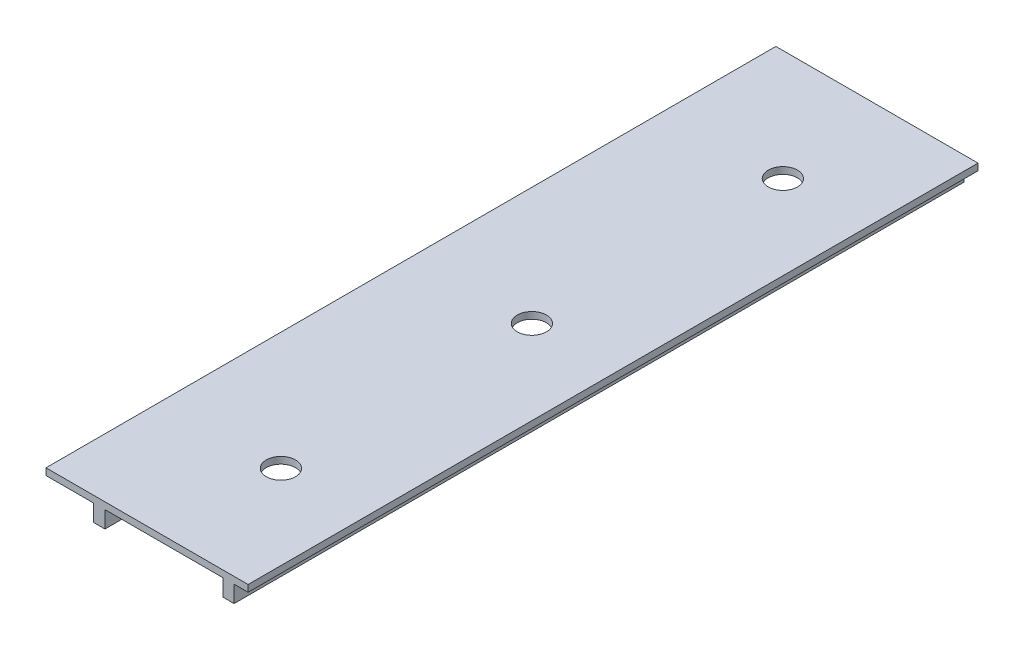
ISO-10303-21;
HEADER;
FILE_DESCRIPTION(('STEP AP214'),'2;1');
FILE_NAME('part.step','',(''),(''),'','','');
FILE_SCHEMA(('AUTOMOTIVE_DESIGN { 1 0 10303 214 1 1 1 1 }'));
ENDSEC;
DATA;
#1=APPLICATION_CONTEXT('core data for automotive mechanical design processes');
#2=APPLICATION_PROTOCOL_DEFINITION('international standard','automotive_design',2000,#1);
#3=PRODUCT_CONTEXT('',#1,'mechanical');
#4=PRODUCT('Part','Part','',(#3));
#5=PRODUCT_RELATED_PRODUCT_CATEGORY('part','',(#4));
#6=PRODUCT_DEFINITION_FORMATION('','',#4);
#7=PRODUCT_DEFINITION_CONTEXT('part definition',#1,'design');
#8=PRODUCT_DEFINITION('design','',#6,#7);
#9=PRODUCT_DEFINITION_SHAPE('','',#8);
#10=(LENGTH_UNIT() NAMED_UNIT(*) SI_UNIT(.MILLI.,.METRE.));
#11=(NAMED_UNIT(*) PLANE_ANGLE_UNIT() SI_UNIT($,.RADIAN.));
#12=(NAMED_UNIT(*) SI_UNIT($,.STERADIAN.) SOLID_ANGLE_UNIT());
#13=UNCERTAINTY_MEASURE_WITH_UNIT(LENGTH_MEASURE(1.E-05),#10,'distance_accuracy_value','');
#14=(GEOMETRIC_REPRESENTATION_CONTEXT(3) GLOBAL_UNCERTAINTY_ASSIGNED_CONTEXT((#13)) GLOBAL_UNIT_ASSIGNED_CONTEXT((#10,
#11,#12)) REPRESENTATION_CONTEXT('',''));
#15=CARTESIAN_POINT('',(0.,0.,0.));
#16=DIRECTION('',(0.,0.,1.));
#17=DIRECTION('',(1.,0.,0.));
#18=AXIS2_PLACEMENT_3D('',#15,#16,#17);
#19=CARTESIAN_POINT('',(0.,0.,0.));
#20=DIRECTION('',(0.,-1.,0.));
#21=DIRECTION('',(0.,0.,-1.));
#22=AXIS2_PLACEMENT_3D('',#19,#20,#21);
#23=PLANE('',#22);
#24=CARTESIAN_POINT('',(10.5,0.,-10.4182940778282));
#25=DIRECTION('',(0.,-1.,0.));
#26=DIRECTION('',(0.,0.,-1.));
#27=AXIS2_PLACEMENT_3D('',#24,#25,#26);
#28=CIRCLE('',#27,1.325);
#29=CARTESIAN_POINT('',(9.69281942065692,0.,-11.469048336602));
#30=VERTEX_POINT('',#29);
#31=CARTESIAN_POINT('',(11.3071805793415,0.,-11.4690483366033));
#32=VERTEX_POINT('',#31);
#33=EDGE_CURVE('E43',#30,#32,#28,.T.);
#34=ORIENTED_EDGE('',*,*,#33,.T.);
#35=CARTESIAN_POINT('',(10.5,0.,-10.45));
#36=DIRECTION('',(0.,-1.,0.));
#37=DIRECTION('',(0.,0.,-1.));
#38=AXIS2_PLACEMENT_3D('',#35,#36,#37);
#39=CIRCLE('',#38,1.3);
#40=EDGE_CURVE('E169',#30,#32,#39,.T.);
#41=ORIENTED_EDGE('',*,*,#40,.F.);
#42=EDGE_LOOP('',(#34,#41));
#43=FACE_BOUND('',#42,.T.);
#44=CARTESIAN_POINT('',(10.5,0.,-10.42));
#45=DIRECTION('',(0.,-1.,0.));
#46=DIRECTION('',(0.,0.,-1.));
#47=AXIS2_PLACEMENT_3D('',#44,#45,#46);
#48=CIRCLE('',#47,1.3);
#49=CARTESIAN_POINT('',(10.5,0.,-11.72));
#50=VERTEX_POINT('',#49);
#51=EDGE_CURVE('E249',#50,#50,#48,.T.);
#52=ORIENTED_EDGE('',*,*,#51,.F.);
#53=EDGE_LOOP('',(#52));
#54=FACE_BOUND('',#53,.T.);
#55=CARTESIAN_POINT('',(10.5,0.,-32.77));
#56=DIRECTION('',(0.,-1.,0.));
#57=DIRECTION('',(0.,0.,-1.));
#58=AXIS2_PLACEMENT_3D('',#55,#56,#57);
#59=CIRCLE('',#58,1.3);
#60=CARTESIAN_POINT('',(10.5,0.,-34.07));
#61=VERTEX_POINT('',#60);
#62=EDGE_CURVE('E271',#61,#61,#59,.T.);
#63=ORIENTED_EDGE('',*,*,#62,.F.);
#64=EDGE_LOOP('',(#63));
#65=FACE_BOUND('',#64,.T.);
#66=DIRECTION('',(0.,0.,-1.));
#67=VECTOR('',#66,1.);
#68=CARTESIAN_POINT('',(15.75,0.,0.));
#69=LINE('',#68,#67);
#70=CARTESIAN_POINT('',(15.75,0.,0.));
#71=VERTEX_POINT('',#70);
#72=CARTESIAN_POINT('',(15.75,0.,-65.));
#73=VERTEX_POINT('',#72);
#74=EDGE_CURVE('E179',#71,#73,#69,.T.);
#75=ORIENTED_EDGE('',*,*,#74,.F.);
#76=DIRECTION('',(1.,0.,0.));
#77=VECTOR('',#76,1.);
#78=CARTESIAN_POINT('',(0.,0.,0.));
#79=LINE('',#78,#77);
#80=CARTESIAN_POINT('',(5.25,0.,0.));
#81=VERTEX_POINT('',#80);
#82=EDGE_CURVE('E253',#81,#71,#79,.T.);
#83=ORIENTED_EDGE('',*,*,#82,.F.);
#84=DIRECTION('',(0.,0.,-1.));
#85=VECTOR('',#84,1.);
#86=CARTESIAN_POINT('',(5.25,0.,0.));
#87=LINE('',#86,#85);
#88=CARTESIAN_POINT('',(5.25,0.,-65.));
#89=VERTEX_POINT('',#88);
#90=EDGE_CURVE('E199',#81,#89,#87,.T.);
#91=ORIENTED_EDGE('',*,*,#90,.T.);
#92=DIRECTION('',(-1.,0.,0.));
#93=VECTOR('',#92,1.);
#94=CARTESIAN_POINT('',(0.,0.,-65.));
#95=LINE('',#94,#93);
#96=EDGE_CURVE('E257',#73,#89,#95,.T.);
#97=ORIENTED_EDGE('',*,*,#96,.F.);
#98=EDGE_LOOP('',(#75,#83,#91,#97));
#99=FACE_BOUND('',#98,.T.);
#100=CARTESIAN_POINT('',(10.5,0.,-55.15));
#101=DIRECTION('',(0.,-1.,0.));
#102=DIRECTION('',(0.,0.,-1.));
#103=AXIS2_PLACEMENT_3D('',#100,#101,#102);
#104=CIRCLE('',#103,1.3);
#105=CARTESIAN_POINT('',(9.77453570900865,0.,-56.2287499999984));
#106=VERTEX_POINT('',#105);
#107=CARTESIAN_POINT('',(11.2254642909895,0.,-56.2287499999996));
#108=VERTEX_POINT('',#107);
#109=EDGE_CURVE('E165',#106,#108,#104,.T.);
#110=ORIENTED_EDGE('',*,*,#109,.F.);
#111=CARTESIAN_POINT('',(10.5,0.,-55.12));
#112=DIRECTION('',(0.,-1.,0.));
#113=DIRECTION('',(0.,0.,-1.));
#114=AXIS2_PLACEMENT_3D('',#111,#112,#113);
#115=CIRCLE('',#114,1.325);
#116=EDGE_CURVE('E11',#106,#108,#115,.T.);
#117=ORIENTED_EDGE('',*,*,#116,.T.);
#118=EDGE_LOOP('',(#110,#117));
#119=FACE_BOUND('',#118,.T.);
#120=CARTESIAN_POINT('',(10.5,0.,-55.12));
#121=DIRECTION('',(0.,-1.,0.));
#122=DIRECTION('',(0.,0.,-1.));
#123=AXIS2_PLACEMENT_3D('',#120,#121,#122);
#124=CIRCLE('',#123,1.3);
#125=CARTESIAN_POINT('',(10.5,0.,-56.42));
#126=VERTEX_POINT('',#125);
#127=EDGE_CURVE('E228',#126,#126,#124,.T.);
#128=ORIENTED_EDGE('',*,*,#127,.F.);
#129=EDGE_LOOP('',(#128));
#130=FACE_BOUND('',#129,.T.);
#131=ADVANCED_FACE('F35',(#43,#54,#65,#99,#119,#130),#23,.T.);
#132=DIRECTION('',(0.,0.,-1.));
#133=VECTOR('',#132,1.);
#134=CARTESIAN_POINT('',(16.75,0.,0.));
#135=LINE('',#134,#133);
#136=CARTESIAN_POINT('',(16.75,0.,0.));
#137=VERTEX_POINT('',#136);
#138=CARTESIAN_POINT('',(16.75,0.,-65.));
#139=VERTEX_POINT('',#138);
#140=EDGE_CURVE('E174',#137,#139,#135,.T.);
#141=ORIENTED_EDGE('',*,*,#140,.T.);
#142=CARTESIAN_POINT('',(18.,0.,-65.));
#143=VERTEX_POINT('',#142);
#144=EDGE_CURVE('E238',#143,#139,#95,.T.);
#145=ORIENTED_EDGE('',*,*,#144,.F.);
#146=DIRECTION('',(0.,0.,-1.));
#147=VECTOR('',#146,1.);
#148=CARTESIAN_POINT('',(18.,0.,0.));
#149=LINE('',#148,#147);
#150=CARTESIAN_POINT('',(18.,0.,0.));
#151=VERTEX_POINT('',#150);
#152=EDGE_CURVE('E252',#151,#143,#149,.T.);
#153=ORIENTED_EDGE('',*,*,#152,.F.);
#154=EDGE_CURVE('E248',#137,#151,#79,.T.);
#155=ORIENTED_EDGE('',*,*,#154,.F.);
#156=EDGE_LOOP('',(#141,#145,#153,#155));
#157=FACE_BOUND('',#156,.T.);
#158=ADVANCED_FACE('F278',(#157),#23,.T.);
#159=CARTESIAN_POINT('',(0.,0.6,0.));
#160=DIRECTION('',(1.,0.,0.));
#161=DIRECTION('',(0.,0.,-1.));
#162=AXIS2_PLACEMENT_3D('',#159,#160,#161);
#163=PLANE('',#162);
#164=DIRECTION('',(0.,0.,1.));
#165=VECTOR('',#164,1.);
#166=CARTESIAN_POINT('',(0.,0.,0.));
#167=LINE('',#166,#165);
#168=CARTESIAN_POINT('',(0.,0.,-65.));
#169=VERTEX_POINT('',#168);
#170=CARTESIAN_POINT('',(0.,0.,0.));
#171=VERTEX_POINT('',#170);
#172=EDGE_CURVE('E245',#169,#171,#167,.T.);
#173=ORIENTED_EDGE('',*,*,#172,.T.);
#174=DIRECTION('',(0.,-1.,0.));
#175=VECTOR('',#174,1.);
#176=CARTESIAN_POINT('',(0.,0.6,0.));
#177=LINE('',#176,#175);
#178=CARTESIAN_POINT('',(0.,0.6,0.));
#179=VERTEX_POINT('',#178);
#180=EDGE_CURVE('E266',#179,#171,#177,.T.);
#181=ORIENTED_EDGE('',*,*,#180,.F.);
#182=DIRECTION('',(0.,0.,1.));
#183=VECTOR('',#182,1.);
#184=CARTESIAN_POINT('',(0.,0.6,0.));
#185=LINE('',#184,#183);
#186=CARTESIAN_POINT('',(0.,0.6,-65.));
#187=VERTEX_POINT('',#186);
#188=EDGE_CURVE('E234',#187,#179,#185,.T.);
#189=ORIENTED_EDGE('',*,*,#188,.F.);
#190=DIRECTION('',(0.,-1.,0.));
#191=VECTOR('',#190,1.);
#192=CARTESIAN_POINT('',(0.,0.6,-65.));
#193=LINE('',#192,#191);
#194=EDGE_CURVE('E244',#187,#169,#193,.T.);
#195=ORIENTED_EDGE('',*,*,#194,.T.);
#196=EDGE_LOOP('',(#173,#181,#189,#195));
#197=FACE_BOUND('',#196,.T.);
#198=ADVANCED_FACE('F37',(#197),#163,.F.);
#199=CARTESIAN_POINT('',(0.,0.6,0.));
#200=DIRECTION('',(0.,0.,-1.));
#201=DIRECTION('',(-1.,0.,0.));
#202=AXIS2_PLACEMENT_3D('',#199,#200,#201);
#203=PLANE('',#202);
#204=CARTESIAN_POINT('',(4.24999999999999,0.,0.));
#205=VERTEX_POINT('',#204);
#206=EDGE_CURVE('E250',#171,#205,#79,.T.);
#207=ORIENTED_EDGE('',*,*,#206,.T.);
#208=DIRECTION('',(0.,1.,0.));
#209=VECTOR('',#208,1.);
#210=CARTESIAN_POINT('',(4.24999999999999,-1.5,0.));
#211=LINE('',#210,#209);
#212=CARTESIAN_POINT('',(4.24999999999999,-1.5,0.));
#213=VERTEX_POINT('',#212);
#214=EDGE_CURVE('E216',#213,#205,#211,.T.);
#215=ORIENTED_EDGE('',*,*,#214,.F.);
#216=DIRECTION('',(-1.,0.,0.));
#217=VECTOR('',#216,1.);
#218=CARTESIAN_POINT('',(0.,-1.5,0.));
#219=LINE('',#218,#217);
#220=CARTESIAN_POINT('',(5.25,-1.5,0.));
#221=VERTEX_POINT('',#220);
#222=EDGE_CURVE('E206',#221,#213,#219,.T.);
#223=ORIENTED_EDGE('',*,*,#222,.F.);
#224=DIRECTION('',(0.,1.,0.));
#225=VECTOR('',#224,1.);
#226=CARTESIAN_POINT('',(5.25,-1.5,0.));
#227=LINE('',#226,#225);
#228=EDGE_CURVE('E219',#221,#81,#227,.T.);
#229=ORIENTED_EDGE('',*,*,#228,.T.);
#230=ORIENTED_EDGE('',*,*,#82,.T.);
#231=DIRECTION('',(0.,1.,0.));
#232=VECTOR('',#231,1.);
#233=CARTESIAN_POINT('',(15.75,-1.5,0.));
#234=LINE('',#233,#232);
#235=CARTESIAN_POINT('',(15.75,-1.5,0.));
#236=VERTEX_POINT('',#235);
#237=EDGE_CURVE('E194',#236,#71,#234,.T.);
#238=ORIENTED_EDGE('',*,*,#237,.F.);
#239=DIRECTION('',(-1.,0.,0.));
#240=VECTOR('',#239,1.);
#241=CARTESIAN_POINT('',(0.,-1.5,0.));
#242=LINE('',#241,#240);
#243=CARTESIAN_POINT('',(16.75,-1.5,0.));
#244=VERTEX_POINT('',#243);
#245=EDGE_CURVE('E178',#244,#236,#242,.T.);
#246=ORIENTED_EDGE('',*,*,#245,.F.);
#247=DIRECTION('',(0.,1.,0.));
#248=VECTOR('',#247,1.);
#249=CARTESIAN_POINT('',(16.75,-1.5,0.));
#250=LINE('',#249,#248);
#251=EDGE_CURVE('E197',#244,#137,#250,.T.);
#252=ORIENTED_EDGE('',*,*,#251,.T.);
#253=ORIENTED_EDGE('',*,*,#154,.T.);
#254=DIRECTION('',(0.,-1.,0.));
#255=VECTOR('',#254,1.);
#256=CARTESIAN_POINT('',(18.,0.6,0.));
#257=LINE('',#256,#255);
#258=CARTESIAN_POINT('',(18.,0.6,0.));
#259=VERTEX_POINT('',#258);
#260=EDGE_CURVE('E263',#259,#151,#257,.T.);
#261=ORIENTED_EDGE('',*,*,#260,.F.);
#262=DIRECTION('',(1.,0.,0.));
#263=VECTOR('',#262,1.);
#264=CARTESIAN_POINT('',(0.,0.6,0.));
#265=LINE('',#264,#263);
#266=EDGE_CURVE('E237',#179,#259,#265,.T.);
#267=ORIENTED_EDGE('',*,*,#266,.F.);
#268=ORIENTED_EDGE('',*,*,#180,.T.);
#269=EDGE_LOOP('',(#207,#215,#223,#229,#230,#238,#246,#252,#253,#261,#267,#268));
#270=FACE_BOUND('',#269,.T.);
#271=ADVANCED_FACE('F333',(#270),#203,.F.);
#272=CARTESIAN_POINT('',(18.,0.6,0.));
#273=DIRECTION('',(-1.,0.,0.));
#274=DIRECTION('',(0.,0.,1.));
#275=AXIS2_PLACEMENT_3D('',#272,#273,#274);
#276=PLANE('',#275);
#277=ORIENTED_EDGE('',*,*,#152,.T.);
#278=DIRECTION('',(0.,-1.,0.));
#279=VECTOR('',#278,1.);
#280=CARTESIAN_POINT('',(18.,0.6,-65.));
#281=LINE('',#280,#279);
#282=CARTESIAN_POINT('',(18.,0.6,-65.));
#283=VERTEX_POINT('',#282);
#284=EDGE_CURVE('E260',#283,#143,#281,.T.);
#285=ORIENTED_EDGE('',*,*,#284,.F.);
#286=DIRECTION('',(0.,0.,-1.));
#287=VECTOR('',#286,1.);
#288=CARTESIAN_POINT('',(18.,0.6,0.));
#289=LINE('',#288,#287);
#290=EDGE_CURVE('E240',#259,#283,#289,.T.);
#291=ORIENTED_EDGE('',*,*,#290,.F.);
#292=ORIENTED_EDGE('',*,*,#260,.T.);
#293=EDGE_LOOP('',(#277,#285,#291,#292));
#294=FACE_BOUND('',#293,.T.);
#295=ADVANCED_FACE('F330',(#294),#276,.F.);
#296=CARTESIAN_POINT('',(0.,0.6,-65.));
#297=DIRECTION('',(0.,0.,1.));
#298=DIRECTION('',(1.,0.,0.));
#299=AXIS2_PLACEMENT_3D('',#296,#297,#298);
#300=PLANE('',#299);
#301=ORIENTED_EDGE('',*,*,#144,.T.);
#302=DIRECTION('',(0.,1.,0.));
#303=VECTOR('',#302,1.);
#304=CARTESIAN_POINT('',(16.75,-1.5,-65.));
#305=LINE('',#304,#303);
#306=CARTESIAN_POINT('',(16.75,-1.5,-65.));
#307=VERTEX_POINT('',#306);
#308=EDGE_CURVE('E185',#307,#139,#305,.T.);
#309=ORIENTED_EDGE('',*,*,#308,.F.);
#310=DIRECTION('',(1.,0.,0.));
#311=VECTOR('',#310,1.);
#312=CARTESIAN_POINT('',(0.,-1.5,-65.));
#313=LINE('',#312,#311);
#314=CARTESIAN_POINT('',(15.75,-1.5,-65.));
#315=VERTEX_POINT('',#314);
#316=EDGE_CURVE('E183',#315,#307,#313,.T.);
#317=ORIENTED_EDGE('',*,*,#316,.F.);
#318=DIRECTION('',(0.,1.,0.));
#319=VECTOR('',#318,1.);
#320=CARTESIAN_POINT('',(15.75,-1.5,-65.));
#321=LINE('',#320,#319);
#322=EDGE_CURVE('E192',#315,#73,#321,.T.);
#323=ORIENTED_EDGE('',*,*,#322,.T.);
#324=ORIENTED_EDGE('',*,*,#96,.T.);
#325=DIRECTION('',(0.,1.,0.));
#326=VECTOR('',#325,1.);
#327=CARTESIAN_POINT('',(5.25,-1.5,-65.));
#328=LINE('',#327,#326);
#329=CARTESIAN_POINT('',(5.25,-1.5,-65.));
#330=VERTEX_POINT('',#329);
#331=EDGE_CURVE('E221',#330,#89,#328,.T.);
#332=ORIENTED_EDGE('',*,*,#331,.F.);
#333=DIRECTION('',(1.,0.,0.));
#334=VECTOR('',#333,1.);
#335=CARTESIAN_POINT('',(0.,-1.5,-65.));
#336=LINE('',#335,#334);
#337=CARTESIAN_POINT('',(4.24999999999999,-1.5,-65.));
#338=VERTEX_POINT('',#337);
#339=EDGE_CURVE('E200',#338,#330,#336,.T.);
#340=ORIENTED_EDGE('',*,*,#339,.F.);
#341=DIRECTION('',(0.,1.,0.));
#342=VECTOR('',#341,1.);
#343=CARTESIAN_POINT('',(4.24999999999999,-1.5,-65.));
#344=LINE('',#343,#342);
#345=CARTESIAN_POINT('',(4.24999999999999,0.,-65.));
#346=VERTEX_POINT('',#345);
#347=EDGE_CURVE('E210',#338,#346,#344,.T.);
#348=ORIENTED_EDGE('',*,*,#347,.T.);
#349=EDGE_CURVE('E255',#346,#169,#95,.T.);
#350=ORIENTED_EDGE('',*,*,#349,.T.);
#351=ORIENTED_EDGE('',*,*,#194,.F.);
#352=DIRECTION('',(-1.,0.,0.));
#353=VECTOR('',#352,1.);
#354=CARTESIAN_POINT('',(0.,0.6,-65.));
#355=LINE('',#354,#353);
#356=EDGE_CURVE('E242',#283,#187,#355,.T.);
#357=ORIENTED_EDGE('',*,*,#356,.F.);
#358=ORIENTED_EDGE('',*,*,#284,.T.);
#359=EDGE_LOOP('',(#301,#309,#317,#323,#324,#332,#340,#348,#350,#351,#357,#358));
#360=FACE_BOUND('',#359,.T.);
#361=ADVANCED_FACE('F303',(#360),#300,.F.);
#362=CARTESIAN_POINT('',(0.,0.6,0.));
#363=DIRECTION('',(0.,-1.,0.));
#364=DIRECTION('',(0.,0.,-1.));
#365=AXIS2_PLACEMENT_3D('',#362,#363,#364);
#366=PLANE('',#365);
#367=ORIENTED_EDGE('',*,*,#356,.T.);
#368=ORIENTED_EDGE('',*,*,#188,.T.);
#369=ORIENTED_EDGE('',*,*,#266,.T.);
#370=ORIENTED_EDGE('',*,*,#290,.T.);
#371=EDGE_LOOP('',(#367,#368,#369,#370));
#372=FACE_BOUND('',#371,.T.);
#373=CARTESIAN_POINT('',(10.5,0.6,-55.12));
#374=DIRECTION('',(0.,1.,0.));
#375=DIRECTION('',(0.,0.,1.));
#376=AXIS2_PLACEMENT_3D('',#373,#374,#375);
#377=CIRCLE('',#376,1.3);
#378=CARTESIAN_POINT('',(10.5,0.6,-53.82));
#379=VERTEX_POINT('',#378);
#380=EDGE_CURVE('E224',#379,#379,#377,.T.);
#381=ORIENTED_EDGE('',*,*,#380,.F.);
#382=EDGE_LOOP('',(#381));
#383=FACE_BOUND('',#382,.T.);
#384=CARTESIAN_POINT('',(10.5,0.6,-32.77));
#385=DIRECTION('',(0.,1.,0.));
#386=DIRECTION('',(0.,0.,1.));
#387=AXIS2_PLACEMENT_3D('',#384,#385,#386);
#388=CIRCLE('',#387,1.3);
#389=CARTESIAN_POINT('',(10.5,0.6,-31.47));
#390=VERTEX_POINT('',#389);
#391=EDGE_CURVE('E229',#390,#390,#388,.T.);
#392=ORIENTED_EDGE('',*,*,#391,.F.);
#393=EDGE_LOOP('',(#392));
#394=FACE_BOUND('',#393,.T.);
#395=CARTESIAN_POINT('',(10.5,0.6,-10.42));
#396=DIRECTION('',(0.,1.,0.));
#397=DIRECTION('',(0.,0.,1.));
#398=AXIS2_PLACEMENT_3D('',#395,#396,#397);
#399=CIRCLE('',#398,1.3);
#400=CARTESIAN_POINT('',(10.5,0.6,-9.12));
#401=VERTEX_POINT('',#400);
#402=EDGE_CURVE('E225',#401,#401,#399,.T.);
#403=ORIENTED_EDGE('',*,*,#402,.F.);
#404=EDGE_LOOP('',(#403));
#405=FACE_BOUND('',#404,.T.);
#406=ADVANCED_FACE('F300',(#372,#383,#394,#405),#366,.F.);
#407=DIRECTION('',(0.,0.,-1.));
#408=VECTOR('',#407,1.);
#409=CARTESIAN_POINT('',(4.25,0.,0.));
#410=LINE('',#409,#408);
#411=EDGE_CURVE('E203',#205,#346,#410,.T.);
#412=ORIENTED_EDGE('',*,*,#411,.F.);
#413=ORIENTED_EDGE('',*,*,#206,.F.);
#414=ORIENTED_EDGE('',*,*,#172,.F.);
#415=ORIENTED_EDGE('',*,*,#349,.F.);
#416=EDGE_LOOP('',(#412,#413,#414,#415));
#417=FACE_BOUND('',#416,.T.);
#418=ADVANCED_FACE('F280',(#417),#23,.T.);
#419=CARTESIAN_POINT('',(10.5,-9.4,-55.12));
#420=DIRECTION('',(0.,1.,0.));
#421=DIRECTION('',(0.,0.,1.));
#422=AXIS2_PLACEMENT_3D('',#419,#420,#421);
#423=CYLINDRICAL_SURFACE('',#422,1.3);
#424=ORIENTED_EDGE('',*,*,#127,.T.);
#425=EDGE_LOOP('',(#424));
#426=FACE_BOUND('',#425,.T.);
#427=ORIENTED_EDGE('',*,*,#380,.T.);
#428=EDGE_LOOP('',(#427));
#429=FACE_BOUND('',#428,.T.);
#430=ADVANCED_FACE('F293',(#426,#429),#423,.F.);
#431=CARTESIAN_POINT('',(10.5,-9.4,-32.77));
#432=DIRECTION('',(0.,1.,0.));
#433=DIRECTION('',(0.,0.,1.));
#434=AXIS2_PLACEMENT_3D('',#431,#432,#433);
#435=CYLINDRICAL_SURFACE('',#434,1.3);
#436=ORIENTED_EDGE('',*,*,#62,.T.);
#437=EDGE_LOOP('',(#436));
#438=FACE_BOUND('',#437,.T.);
#439=ORIENTED_EDGE('',*,*,#391,.T.);
#440=EDGE_LOOP('',(#439));
#441=FACE_BOUND('',#440,.T.);
#442=ADVANCED_FACE('F296',(#438,#441),#435,.F.);
#443=CARTESIAN_POINT('',(10.5,-9.4,-10.42));
#444=DIRECTION('',(0.,1.,0.));
#445=DIRECTION('',(0.,0.,1.));
#446=AXIS2_PLACEMENT_3D('',#443,#444,#445);
#447=CYLINDRICAL_SURFACE('',#446,1.3);
#448=ORIENTED_EDGE('',*,*,#51,.T.);
#449=EDGE_LOOP('',(#448));
#450=FACE_BOUND('',#449,.T.);
#451=ORIENTED_EDGE('',*,*,#402,.T.);
#452=EDGE_LOOP('',(#451));
#453=FACE_BOUND('',#452,.T.);
#454=ADVANCED_FACE('F310',(#450,#453),#447,.F.);
#455=CARTESIAN_POINT('',(5.25,-1.5,0.));
#456=DIRECTION('',(1.,0.,0.));
#457=DIRECTION('',(0.,0.,-1.));
#458=AXIS2_PLACEMENT_3D('',#455,#456,#457);
#459=PLANE('',#458);
#460=ORIENTED_EDGE('',*,*,#90,.F.);
#461=ORIENTED_EDGE('',*,*,#228,.F.);
#462=DIRECTION('',(0.,0.,-1.));
#463=VECTOR('',#462,1.);
#464=CARTESIAN_POINT('',(5.25,-1.5,0.));
#465=LINE('',#464,#463);
#466=EDGE_CURVE('E202',#221,#330,#465,.T.);
#467=ORIENTED_EDGE('',*,*,#466,.T.);
#468=ORIENTED_EDGE('',*,*,#331,.T.);
#469=EDGE_LOOP('',(#460,#461,#467,#468));
#470=FACE_BOUND('',#469,.T.);
#471=ADVANCED_FACE('F312',(#470),#459,.T.);
#472=CARTESIAN_POINT('',(4.25,-1.5,0.));
#473=DIRECTION('',(1.,0.,0.));
#474=DIRECTION('',(0.,0.,-1.));
#475=AXIS2_PLACEMENT_3D('',#472,#473,#474);
#476=PLANE('',#475);
#477=ORIENTED_EDGE('',*,*,#411,.T.);
#478=ORIENTED_EDGE('',*,*,#347,.F.);
#479=DIRECTION('',(0.,0.,-1.));
#480=VECTOR('',#479,1.);
#481=CARTESIAN_POINT('',(4.25,-1.5,0.));
#482=LINE('',#481,#480);
#483=EDGE_CURVE('E208',#213,#338,#482,.T.);
#484=ORIENTED_EDGE('',*,*,#483,.F.);
#485=ORIENTED_EDGE('',*,*,#214,.T.);
#486=EDGE_LOOP('',(#477,#478,#484,#485));
#487=FACE_BOUND('',#486,.T.);
#488=ADVANCED_FACE('F319',(#487),#476,.F.);
#489=CARTESIAN_POINT('',(0.,-1.5,0.));
#490=DIRECTION('',(0.,-1.,0.));
#491=DIRECTION('',(0.,0.,-1.));
#492=AXIS2_PLACEMENT_3D('',#489,#490,#491);
#493=PLANE('',#492);
#494=ORIENTED_EDGE('',*,*,#339,.T.);
#495=ORIENTED_EDGE('',*,*,#466,.F.);
#496=ORIENTED_EDGE('',*,*,#222,.T.);
#497=ORIENTED_EDGE('',*,*,#483,.T.);
#498=EDGE_LOOP('',(#494,#495,#496,#497));
#499=FACE_BOUND('',#498,.T.);
#500=ADVANCED_FACE('F384',(#499),#493,.T.);
#501=CARTESIAN_POINT('',(16.75,-1.5,0.));
#502=DIRECTION('',(1.,0.,0.));
#503=DIRECTION('',(0.,0.,-1.));
#504=AXIS2_PLACEMENT_3D('',#501,#502,#503);
#505=PLANE('',#504);
#506=ORIENTED_EDGE('',*,*,#140,.F.);
#507=ORIENTED_EDGE('',*,*,#251,.F.);
#508=DIRECTION('',(0.,0.,-1.));
#509=VECTOR('',#508,1.);
#510=CARTESIAN_POINT('',(16.75,-1.5,0.));
#511=LINE('',#510,#509);
#512=EDGE_CURVE('E175',#244,#307,#511,.T.);
#513=ORIENTED_EDGE('',*,*,#512,.T.);
#514=ORIENTED_EDGE('',*,*,#308,.T.);
#515=EDGE_LOOP('',(#506,#507,#513,#514));
#516=FACE_BOUND('',#515,.T.);
#517=ADVANCED_FACE('F370',(#516),#505,.T.);
#518=CARTESIAN_POINT('',(15.75,-1.5,0.));
#519=DIRECTION('',(1.,0.,0.));
#520=DIRECTION('',(0.,0.,-1.));
#521=AXIS2_PLACEMENT_3D('',#518,#519,#520);
#522=PLANE('',#521);
#523=ORIENTED_EDGE('',*,*,#74,.T.);
#524=ORIENTED_EDGE('',*,*,#322,.F.);
#525=DIRECTION('',(0.,0.,-1.));
#526=VECTOR('',#525,1.);
#527=CARTESIAN_POINT('',(15.75,-1.5,0.));
#528=LINE('',#527,#526);
#529=EDGE_CURVE('E181',#236,#315,#528,.T.);
#530=ORIENTED_EDGE('',*,*,#529,.F.);
#531=ORIENTED_EDGE('',*,*,#237,.T.);
#532=EDGE_LOOP('',(#523,#524,#530,#531));
#533=FACE_BOUND('',#532,.T.);
#534=ADVANCED_FACE('F376',(#533),#522,.F.);
#535=CARTESIAN_POINT('',(0.,-1.5,0.));
#536=DIRECTION('',(0.,-1.,0.));
#537=DIRECTION('',(0.,0.,-1.));
#538=AXIS2_PLACEMENT_3D('',#535,#536,#537);
#539=PLANE('',#538);
#540=ORIENTED_EDGE('',*,*,#512,.F.);
#541=ORIENTED_EDGE('',*,*,#245,.T.);
#542=ORIENTED_EDGE('',*,*,#529,.T.);
#543=ORIENTED_EDGE('',*,*,#316,.T.);
#544=EDGE_LOOP('',(#540,#541,#542,#543));
#545=FACE_BOUND('',#544,.T.);
#546=ADVANCED_FACE('F373',(#545),#539,.T.);
#547=CARTESIAN_POINT('',(10.5,0.100000000000244,-10.41850950164));
#548=DIRECTION('',(0.,1.,0.));
#549=DIRECTION('',(0.,0.,1.));
#550=AXIS2_PLACEMENT_3D('',#547,#548,#549);
#551=PLANE('',#550);
#552=CARTESIAN_POINT('',(10.5,0.100000000000244,-10.4182940778282));
#553=DIRECTION('',(0.,1.,0.));
#554=DIRECTION('',(0.,0.,1.));
#555=AXIS2_PLACEMENT_3D('',#552,#553,#554);
#556=CIRCLE('',#555,1.325);
#557=CARTESIAN_POINT('',(9.69281942065692,0.100000000000244,-11.469048336602));
#558=VERTEX_POINT('',#557);
#559=CARTESIAN_POINT('',(11.3071805793415,0.100000000000244,-11.4690483366033));
#560=VERTEX_POINT('',#559);
#561=EDGE_CURVE('E156',#558,#560,#556,.F.);
#562=ORIENTED_EDGE('',*,*,#561,.F.);
#563=CARTESIAN_POINT('',(10.5,0.100000000000244,-10.45));
#564=DIRECTION('',(0.,1.,0.));
#565=DIRECTION('',(0.,0.,1.));
#566=AXIS2_PLACEMENT_3D('',#563,#564,#565);
#567=CIRCLE('',#566,1.3);
#568=EDGE_CURVE('E149',#558,#560,#567,.F.);
#569=ORIENTED_EDGE('',*,*,#568,.T.);
#570=EDGE_LOOP('',(#562,#569));
#571=FACE_BOUND('',#570,.T.);
#572=ADVANCED_FACE('F157',(#571),#551,.F.);
#573=CARTESIAN_POINT('',(10.5,-2.40000000000005,-10.45));
#574=DIRECTION('',(0.,1.,0.));
#575=DIRECTION('',(0.,0.,1.));
#576=AXIS2_PLACEMENT_3D('',#573,#574,#575);
#577=CYLINDRICAL_SURFACE('',#576,1.3);
#578=DIRECTION('',(0.,1.,0.));
#579=VECTOR('',#578,1.);
#580=CARTESIAN_POINT('',(9.69281942065692,0.299999999999951,-11.469048336602));
#581=LINE('',#580,#579);
#582=EDGE_CURVE('E58',#30,#558,#581,.T.);
#583=ORIENTED_EDGE('',*,*,#582,.F.);
#584=ORIENTED_EDGE('',*,*,#40,.T.);
#585=DIRECTION('',(0.,1.,0.));
#586=VECTOR('',#585,1.);
#587=CARTESIAN_POINT('',(11.3071805793415,0.29999999999995,-11.4690483366033));
#588=LINE('',#587,#586);
#589=EDGE_CURVE('E152',#560,#32,#588,.F.);
#590=ORIENTED_EDGE('',*,*,#589,.F.);
#591=ORIENTED_EDGE('',*,*,#568,.F.);
#592=EDGE_LOOP('',(#583,#584,#590,#591));
#593=FACE_BOUND('',#592,.T.);
#594=ADVANCED_FACE('F151',(#593),#577,.F.);
#595=CARTESIAN_POINT('',(10.5,1.00000000000024,-10.4182940778282));
#596=DIRECTION('',(0.,-1.,0.));
#597=DIRECTION('',(0.,0.,-1.));
#598=AXIS2_PLACEMENT_3D('',#595,#596,#597);
#599=CYLINDRICAL_SURFACE('',#598,1.325);
#600=ORIENTED_EDGE('',*,*,#582,.T.);
#601=ORIENTED_EDGE('',*,*,#561,.T.);
#602=ORIENTED_EDGE('',*,*,#589,.T.);
#603=ORIENTED_EDGE('',*,*,#33,.F.);
#604=EDGE_LOOP('',(#600,#601,#602,#603));
#605=FACE_BOUND('',#604,.T.);
#606=ADVANCED_FACE('F161',(#605),#599,.T.);
#607=CARTESIAN_POINT('',(10.5,1.00000000000024,-55.12));
#608=DIRECTION('',(0.,-1.,0.));
#609=DIRECTION('',(0.,0.,-1.));
#610=AXIS2_PLACEMENT_3D('',#607,#608,#609);
#611=CYLINDRICAL_SURFACE('',#610,1.325);
#612=DIRECTION('',(0.,1.,0.));
#613=VECTOR('',#612,1.);
#614=CARTESIAN_POINT('',(9.77453570900865,0.299999999999954,-56.2287499999984));
#615=LINE('',#614,#613);
#616=CARTESIAN_POINT('',(9.77453570900865,0.100000000000241,-56.2287499999984));
#617=VERTEX_POINT('',#616);
#618=EDGE_CURVE('E50',#106,#617,#615,.T.);
#619=ORIENTED_EDGE('',*,*,#618,.T.);
#620=CARTESIAN_POINT('',(10.5,0.100000000000241,-55.12));
#621=DIRECTION('',(0.,1.,0.));
#622=DIRECTION('',(0.,0.,1.));
#623=AXIS2_PLACEMENT_3D('',#620,#621,#622);
#624=CIRCLE('',#623,1.325);
#625=CARTESIAN_POINT('',(11.2254642909895,0.100000000000241,-56.2287499999996));
#626=VERTEX_POINT('',#625);
#627=EDGE_CURVE('E159',#617,#626,#624,.F.);
#628=ORIENTED_EDGE('',*,*,#627,.T.);
#629=DIRECTION('',(0.,1.,0.));
#630=VECTOR('',#629,1.);
#631=CARTESIAN_POINT('',(11.2254642909895,0.299999999999954,-56.2287499999996));
#632=LINE('',#631,#630);
#633=EDGE_CURVE('E514',#626,#108,#632,.F.);
#634=ORIENTED_EDGE('',*,*,#633,.T.);
#635=ORIENTED_EDGE('',*,*,#116,.F.);
#636=EDGE_LOOP('',(#619,#628,#634,#635));
#637=FACE_BOUND('',#636,.T.);
#638=ADVANCED_FACE('F480',(#637),#611,.T.);
#639=CARTESIAN_POINT('',(10.5,-2.40000000000005,-55.15));
#640=DIRECTION('',(0.,1.,0.));
#641=DIRECTION('',(0.,0.,1.));
#642=AXIS2_PLACEMENT_3D('',#639,#640,#641);
#643=CYLINDRICAL_SURFACE('',#642,1.3);
#644=ORIENTED_EDGE('',*,*,#618,.F.);
#645=ORIENTED_EDGE('',*,*,#109,.T.);
#646=ORIENTED_EDGE('',*,*,#633,.F.);
#647=CARTESIAN_POINT('',(10.5,0.100000000000241,-55.15));
#648=DIRECTION('',(0.,1.,0.));
#649=DIRECTION('',(0.,0.,1.));
#650=AXIS2_PLACEMENT_3D('',#647,#648,#649);
#651=CIRCLE('',#650,1.3);
#652=EDGE_CURVE('E154',#617,#626,#651,.F.);
#653=ORIENTED_EDGE('',*,*,#652,.F.);
#654=EDGE_LOOP('',(#644,#645,#646,#653));
#655=FACE_BOUND('',#654,.T.);
#656=ADVANCED_FACE('F489',(#655),#643,.F.);
#657=CARTESIAN_POINT('',(10.5,0.100000000000241,-55.1202154238118));
#658=DIRECTION('',(0.,1.,0.));
#659=DIRECTION('',(0.,0.,1.));
#660=AXIS2_PLACEMENT_3D('',#657,#658,#659);
#661=PLANE('',#660);
#662=ORIENTED_EDGE('',*,*,#627,.F.);
#663=ORIENTED_EDGE('',*,*,#652,.T.);
#664=EDGE_LOOP('',(#662,#663));
#665=FACE_BOUND('',#664,.T.);
#666=ADVANCED_FACE('F499',(#665),#661,.F.);
#667=CLOSED_SHELL('',(#131,#158,#198,#271,#295,#361,#406,#418,#430,#442,#454,#471,#488,#500,
#517,#534,#546,#572,#594,#606,#638,#656,#666));
#668=MANIFOLD_SOLID_BREP('B2',#667);
#669=ADVANCED_BREP_SHAPE_REPRESENTATION('',(#18,#668),#14);
#670=SHAPE_DEFINITION_REPRESENTATION(#9,#669);
ENDSEC;
END-ISO-10303-21;
